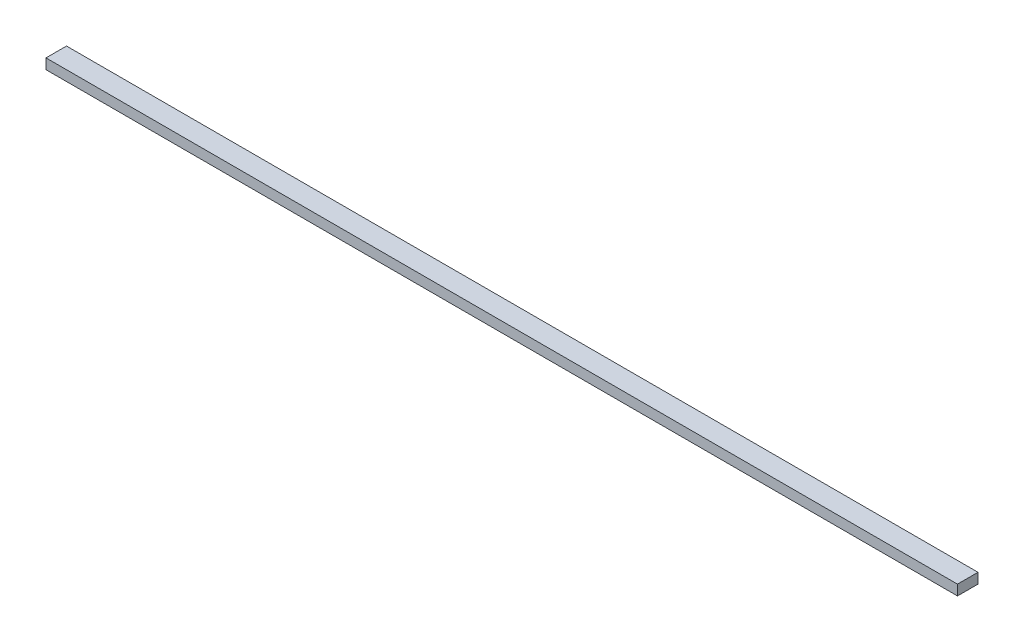
ISO-10303-21;
HEADER;
FILE_DESCRIPTION(('STEP AP214'),'2;1');
FILE_NAME('part.step','',(''),(''),'','','');
FILE_SCHEMA(('AUTOMOTIVE_DESIGN { 1 0 10303 214 1 1 1 1 }'));
ENDSEC;
DATA;
#1=APPLICATION_CONTEXT('core data for automotive mechanical design processes');
#2=APPLICATION_PROTOCOL_DEFINITION('international standard','automotive_design',2000,#1);
#3=PRODUCT_CONTEXT('',#1,'mechanical');
#4=PRODUCT('Part','Part','',(#3));
#5=PRODUCT_RELATED_PRODUCT_CATEGORY('part','',(#4));
#6=PRODUCT_DEFINITION_FORMATION('','',#4);
#7=PRODUCT_DEFINITION_CONTEXT('part definition',#1,'design');
#8=PRODUCT_DEFINITION('design','',#6,#7);
#9=PRODUCT_DEFINITION_SHAPE('','',#8);
#10=(LENGTH_UNIT() NAMED_UNIT(*) SI_UNIT(.MILLI.,.METRE.));
#11=(NAMED_UNIT(*) PLANE_ANGLE_UNIT() SI_UNIT($,.RADIAN.));
#12=(NAMED_UNIT(*) SI_UNIT($,.STERADIAN.) SOLID_ANGLE_UNIT());
#13=UNCERTAINTY_MEASURE_WITH_UNIT(LENGTH_MEASURE(1.E-05),#10,'distance_accuracy_value','');
#14=(GEOMETRIC_REPRESENTATION_CONTEXT(3) GLOBAL_UNCERTAINTY_ASSIGNED_CONTEXT((#13)) GLOBAL_UNIT_ASSIGNED_CONTEXT((#10,
#11,#12)) REPRESENTATION_CONTEXT('',''));
#15=CARTESIAN_POINT('',(0.,0.,0.));
#16=DIRECTION('',(0.,0.,1.));
#17=DIRECTION('',(1.,0.,0.));
#18=AXIS2_PLACEMENT_3D('',#15,#16,#17);
#19=CARTESIAN_POINT('',(-444.265,10.,-9.99999999999998));
#20=DIRECTION('',(1.,0.,0.));
#21=DIRECTION('',(0.,0.,-1.));
#22=AXIS2_PLACEMENT_3D('',#19,#20,#21);
#23=PLANE('',#22);
#24=DIRECTION('',(0.,0.,1.));
#25=VECTOR('',#24,1.);
#26=CARTESIAN_POINT('',(-444.265,0.,-9.99999999999998));
#27=LINE('',#26,#25);
#28=CARTESIAN_POINT('',(-444.265,0.,-9.99999999999998));
#29=VERTEX_POINT('',#28);
#30=CARTESIAN_POINT('',(-444.265,0.,10.));
#31=VERTEX_POINT('',#30);
#32=EDGE_CURVE('E95',#29,#31,#27,.T.);
#33=ORIENTED_EDGE('',*,*,#32,.T.);
#34=DIRECTION('',(0.,-1.,0.));
#35=VECTOR('',#34,1.);
#36=CARTESIAN_POINT('',(-444.265,10.,10.));
#37=LINE('',#36,#35);
#38=CARTESIAN_POINT('',(-444.265,10.,10.));
#39=VERTEX_POINT('',#38);
#40=EDGE_CURVE('E11',#39,#31,#37,.T.);
#41=ORIENTED_EDGE('',*,*,#40,.F.);
#42=DIRECTION('',(0.,0.,1.));
#43=VECTOR('',#42,1.);
#44=CARTESIAN_POINT('',(-444.265,10.,-9.99999999999998));
#45=LINE('',#44,#43);
#46=CARTESIAN_POINT('',(-444.265,10.,-9.99999999999998));
#47=VERTEX_POINT('',#46);
#48=EDGE_CURVE('E83',#47,#39,#45,.T.);
#49=ORIENTED_EDGE('',*,*,#48,.F.);
#50=DIRECTION('',(0.,-1.,0.));
#51=VECTOR('',#50,1.);
#52=CARTESIAN_POINT('',(-444.265,10.,-9.99999999999998));
#53=LINE('',#52,#51);
#54=EDGE_CURVE('E91',#47,#29,#53,.T.);
#55=ORIENTED_EDGE('',*,*,#54,.T.);
#56=EDGE_LOOP('',(#33,#41,#49,#55));
#57=FACE_BOUND('',#56,.T.);
#58=ADVANCED_FACE('F32',(#57),#23,.F.);
#59=CARTESIAN_POINT('',(-444.265,10.,10.));
#60=DIRECTION('',(0.,0.,-1.));
#61=DIRECTION('',(-1.,0.,0.));
#62=AXIS2_PLACEMENT_3D('',#59,#60,#61);
#63=PLANE('',#62);
#64=DIRECTION('',(1.,0.,0.));
#65=VECTOR('',#64,1.);
#66=CARTESIAN_POINT('',(-444.265,0.,10.));
#67=LINE('',#66,#65);
#68=CARTESIAN_POINT('',(444.265,0.,10.));
#69=VERTEX_POINT('',#68);
#70=EDGE_CURVE('E87',#31,#69,#67,.T.);
#71=ORIENTED_EDGE('',*,*,#70,.T.);
#72=DIRECTION('',(0.,-1.,0.));
#73=VECTOR('',#72,1.);
#74=CARTESIAN_POINT('',(444.265,10.,10.));
#75=LINE('',#74,#73);
#76=CARTESIAN_POINT('',(444.265,10.,10.));
#77=VERTEX_POINT('',#76);
#78=EDGE_CURVE('E40',#77,#69,#75,.T.);
#79=ORIENTED_EDGE('',*,*,#78,.F.);
#80=DIRECTION('',(1.,0.,0.));
#81=VECTOR('',#80,1.);
#82=CARTESIAN_POINT('',(-444.265,10.,10.));
#83=LINE('',#82,#81);
#84=EDGE_CURVE('E78',#39,#77,#83,.T.);
#85=ORIENTED_EDGE('',*,*,#84,.F.);
#86=ORIENTED_EDGE('',*,*,#40,.T.);
#87=EDGE_LOOP('',(#71,#79,#85,#86));
#88=FACE_BOUND('',#87,.T.);
#89=ADVANCED_FACE('F86',(#88),#63,.F.);
#90=CARTESIAN_POINT('',(444.265,10.,-9.99999999999995));
#91=DIRECTION('',(-1.,0.,0.));
#92=DIRECTION('',(0.,0.,1.));
#93=AXIS2_PLACEMENT_3D('',#90,#91,#92);
#94=PLANE('',#93);
#95=DIRECTION('',(0.,0.,-1.));
#96=VECTOR('',#95,1.);
#97=CARTESIAN_POINT('',(444.265,0.,-9.99999999999995));
#98=LINE('',#97,#96);
#99=CARTESIAN_POINT('',(444.265,0.,-9.99999999999995));
#100=VERTEX_POINT('',#99);
#101=EDGE_CURVE('E65',#69,#100,#98,.T.);
#102=ORIENTED_EDGE('',*,*,#101,.T.);
#103=DIRECTION('',(0.,-1.,0.));
#104=VECTOR('',#103,1.);
#105=CARTESIAN_POINT('',(444.265,10.,-9.99999999999995));
#106=LINE('',#105,#104);
#107=CARTESIAN_POINT('',(444.265,10.,-9.99999999999995));
#108=VERTEX_POINT('',#107);
#109=EDGE_CURVE('E88',#108,#100,#106,.T.);
#110=ORIENTED_EDGE('',*,*,#109,.F.);
#111=DIRECTION('',(0.,0.,-1.));
#112=VECTOR('',#111,1.);
#113=CARTESIAN_POINT('',(444.265,10.,-9.99999999999995));
#114=LINE('',#113,#112);
#115=EDGE_CURVE('E81',#77,#108,#114,.T.);
#116=ORIENTED_EDGE('',*,*,#115,.F.);
#117=ORIENTED_EDGE('',*,*,#78,.T.);
#118=EDGE_LOOP('',(#102,#110,#116,#117));
#119=FACE_BOUND('',#118,.T.);
#120=ADVANCED_FACE('F89',(#119),#94,.F.);
#121=CARTESIAN_POINT('',(-444.265,10.,-9.99999999999998));
#122=DIRECTION('',(0.,0.,1.));
#123=DIRECTION('',(1.,0.,0.));
#124=AXIS2_PLACEMENT_3D('',#121,#122,#123);
#125=PLANE('',#124);
#126=DIRECTION('',(-1.,0.,0.));
#127=VECTOR('',#126,1.);
#128=CARTESIAN_POINT('',(-444.265,0.,-9.99999999999998));
#129=LINE('',#128,#127);
#130=EDGE_CURVE('E71',#100,#29,#129,.T.);
#131=ORIENTED_EDGE('',*,*,#130,.T.);
#132=ORIENTED_EDGE('',*,*,#54,.F.);
#133=DIRECTION('',(-1.,0.,0.));
#134=VECTOR('',#133,1.);
#135=CARTESIAN_POINT('',(-444.265,10.,-9.99999999999998));
#136=LINE('',#135,#134);
#137=EDGE_CURVE('E48',#108,#47,#136,.T.);
#138=ORIENTED_EDGE('',*,*,#137,.F.);
#139=ORIENTED_EDGE('',*,*,#109,.T.);
#140=EDGE_LOOP('',(#131,#132,#138,#139));
#141=FACE_BOUND('',#140,.T.);
#142=ADVANCED_FACE('F102',(#141),#125,.F.);
#143=CARTESIAN_POINT('',(0.,10.,0.));
#144=DIRECTION('',(0.,1.,0.));
#145=DIRECTION('',(0.,0.,1.));
#146=AXIS2_PLACEMENT_3D('',#143,#144,#145);
#147=PLANE('',#146);
#148=ORIENTED_EDGE('',*,*,#48,.T.);
#149=ORIENTED_EDGE('',*,*,#84,.T.);
#150=ORIENTED_EDGE('',*,*,#115,.T.);
#151=ORIENTED_EDGE('',*,*,#137,.T.);
#152=EDGE_LOOP('',(#148,#149,#150,#151));
#153=FACE_BOUND('',#152,.T.);
#154=ADVANCED_FACE('F79',(#153),#147,.T.);
#155=CARTESIAN_POINT('',(0.,0.,0.));
#156=DIRECTION('',(0.,1.,0.));
#157=DIRECTION('',(0.,0.,1.));
#158=AXIS2_PLACEMENT_3D('',#155,#156,#157);
#159=PLANE('',#158);
#160=ORIENTED_EDGE('',*,*,#32,.F.);
#161=ORIENTED_EDGE('',*,*,#130,.F.);
#162=ORIENTED_EDGE('',*,*,#101,.F.);
#163=ORIENTED_EDGE('',*,*,#70,.F.);
#164=EDGE_LOOP('',(#160,#161,#162,#163));
#165=FACE_BOUND('',#164,.T.);
#166=ADVANCED_FACE('F105',(#165),#159,.F.);
#167=CLOSED_SHELL('',(#58,#89,#120,#142,#154,#166));
#168=MANIFOLD_SOLID_BREP('B2',#167);
#169=ADVANCED_BREP_SHAPE_REPRESENTATION('',(#18,#168),#14);
#170=SHAPE_DEFINITION_REPRESENTATION(#9,#169);
ENDSEC;
END-ISO-10303-21;
